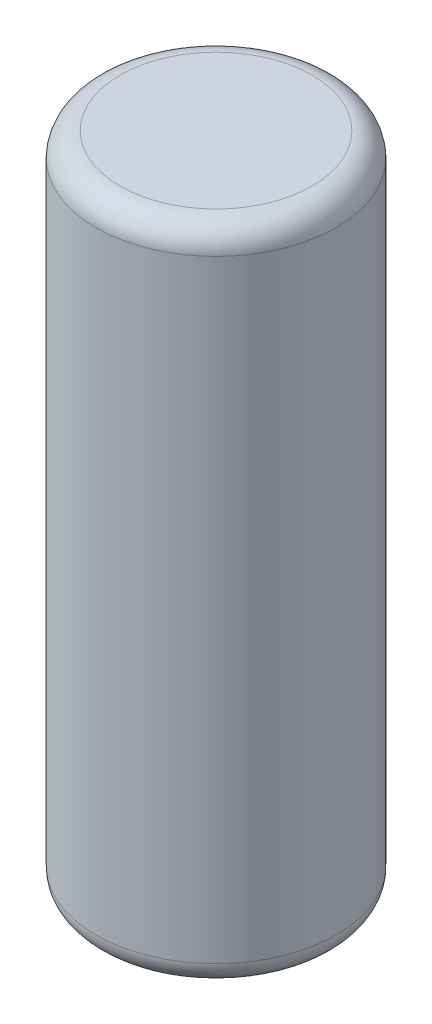
ISO-10303-21;
HEADER;
FILE_DESCRIPTION(('STEP AP214'),'2;1');
FILE_NAME('part.step','',(''),(''),'','','');
FILE_SCHEMA(('AUTOMOTIVE_DESIGN { 1 0 10303 214 1 1 1 1 }'));
ENDSEC;
DATA;
#1=APPLICATION_CONTEXT('core data for automotive mechanical design processes');
#2=APPLICATION_PROTOCOL_DEFINITION('international standard','automotive_design',2000,#1);
#3=PRODUCT_CONTEXT('',#1,'mechanical');
#4=PRODUCT('Part','Part','',(#3));
#5=PRODUCT_RELATED_PRODUCT_CATEGORY('part','',(#4));
#6=PRODUCT_DEFINITION_FORMATION('','',#4);
#7=PRODUCT_DEFINITION_CONTEXT('part definition',#1,'design');
#8=PRODUCT_DEFINITION('design','',#6,#7);
#9=PRODUCT_DEFINITION_SHAPE('','',#8);
#10=(LENGTH_UNIT() NAMED_UNIT(*) SI_UNIT(.MILLI.,.METRE.));
#11=(NAMED_UNIT(*) PLANE_ANGLE_UNIT() SI_UNIT($,.RADIAN.));
#12=(NAMED_UNIT(*) SI_UNIT($,.STERADIAN.) SOLID_ANGLE_UNIT());
#13=UNCERTAINTY_MEASURE_WITH_UNIT(LENGTH_MEASURE(1.E-05),#10,'distance_accuracy_value','');
#14=(GEOMETRIC_REPRESENTATION_CONTEXT(3) GLOBAL_UNCERTAINTY_ASSIGNED_CONTEXT((#13)) GLOBAL_UNIT_ASSIGNED_CONTEXT((#10,
#11,#12)) REPRESENTATION_CONTEXT('',''));
#15=CARTESIAN_POINT('',(0.,0.,0.));
#16=DIRECTION('',(0.,0.,1.));
#17=DIRECTION('',(1.,0.,0.));
#18=AXIS2_PLACEMENT_3D('',#15,#16,#17);
#19=CARTESIAN_POINT('',(0.,275.,0.));
#20=DIRECTION('',(0.,-1.,0.));
#21=DIRECTION('',(0.,0.,-1.));
#22=AXIS2_PLACEMENT_3D('',#19,#20,#21);
#23=CYLINDRICAL_SURFACE('',#22,50.);
#24=CARTESIAN_POINT('',(0.,265.,0.));
#25=DIRECTION('',(0.,1.,0.));
#26=DIRECTION('',(0.,0.,1.));
#27=AXIS2_PLACEMENT_3D('',#24,#25,#26);
#28=CIRCLE('',#27,50.);
#29=CARTESIAN_POINT('',(0.,265.,50.));
#30=VERTEX_POINT('',#29);
#31=EDGE_CURVE('E47',#30,#30,#28,.F.);
#32=ORIENTED_EDGE('',*,*,#31,.T.);
#33=EDGE_LOOP('',(#32));
#34=FACE_BOUND('',#33,.T.);
#35=CARTESIAN_POINT('',(0.,10.,0.));
#36=DIRECTION('',(0.,1.,0.));
#37=DIRECTION('',(0.,0.,1.));
#38=AXIS2_PLACEMENT_3D('',#35,#36,#37);
#39=CIRCLE('',#38,50.);
#40=CARTESIAN_POINT('',(0.,10.,50.));
#41=VERTEX_POINT('',#40);
#42=EDGE_CURVE('E52',#41,#41,#39,.T.);
#43=ORIENTED_EDGE('',*,*,#42,.T.);
#44=EDGE_LOOP('',(#43));
#45=FACE_BOUND('',#44,.T.);
#46=ADVANCED_FACE('F39',(#34,#45),#23,.T.);
#47=CARTESIAN_POINT('',(0.,275.,0.));
#48=DIRECTION('',(0.,1.,0.));
#49=DIRECTION('',(0.,0.,1.));
#50=AXIS2_PLACEMENT_3D('',#47,#48,#49);
#51=PLANE('',#50);
#52=CARTESIAN_POINT('',(0.,275.,0.));
#53=DIRECTION('',(0.,1.,0.));
#54=DIRECTION('',(0.,0.,1.));
#55=AXIS2_PLACEMENT_3D('',#52,#53,#54);
#56=CIRCLE('',#55,40.);
#57=CARTESIAN_POINT('',(0.,275.,40.));
#58=VERTEX_POINT('',#57);
#59=EDGE_CURVE('E57',#58,#58,#56,.T.);
#60=ORIENTED_EDGE('',*,*,#59,.T.);
#61=EDGE_LOOP('',(#60));
#62=FACE_BOUND('',#61,.T.);
#63=ADVANCED_FACE('F64',(#62),#51,.T.);
#64=CARTESIAN_POINT('',(0.,0.,0.));
#65=DIRECTION('',(0.,1.,0.));
#66=DIRECTION('',(0.,0.,1.));
#67=AXIS2_PLACEMENT_3D('',#64,#65,#66);
#68=PLANE('',#67);
#69=CARTESIAN_POINT('',(0.,0.,0.));
#70=DIRECTION('',(0.,1.,0.));
#71=DIRECTION('',(0.,0.,1.));
#72=AXIS2_PLACEMENT_3D('',#69,#70,#71);
#73=CIRCLE('',#72,40.);
#74=CARTESIAN_POINT('',(0.,0.,40.));
#75=VERTEX_POINT('',#74);
#76=EDGE_CURVE('E10',#75,#75,#73,.F.);
#77=ORIENTED_EDGE('',*,*,#76,.T.);
#78=EDGE_LOOP('',(#77));
#79=FACE_BOUND('',#78,.T.);
#80=ADVANCED_FACE('F68',(#79),#68,.F.);
#81=CARTESIAN_POINT('',(0.,265.,0.));
#82=DIRECTION('',(0.,1.,0.));
#83=DIRECTION('',(0.,0.,1.));
#84=AXIS2_PLACEMENT_3D('',#81,#82,#83);
#85=TOROIDAL_SURFACE('',#84,40.,10.);
#86=ORIENTED_EDGE('',*,*,#31,.F.);
#87=EDGE_LOOP('',(#86));
#88=FACE_BOUND('',#87,.T.);
#89=ORIENTED_EDGE('',*,*,#59,.F.);
#90=EDGE_LOOP('',(#89));
#91=FACE_BOUND('',#90,.T.);
#92=ADVANCED_FACE('F66',(#88,#91),#85,.T.);
#93=CARTESIAN_POINT('',(0.,10.,0.));
#94=DIRECTION('',(0.,1.,0.));
#95=DIRECTION('',(0.,0.,1.));
#96=AXIS2_PLACEMENT_3D('',#93,#94,#95);
#97=TOROIDAL_SURFACE('',#96,40.,10.);
#98=ORIENTED_EDGE('',*,*,#76,.F.);
#99=EDGE_LOOP('',(#98));
#100=FACE_BOUND('',#99,.T.);
#101=ORIENTED_EDGE('',*,*,#42,.F.);
#102=EDGE_LOOP('',(#101));
#103=FACE_BOUND('',#102,.T.);
#104=ADVANCED_FACE('F41',(#100,#103),#97,.T.);
#105=CLOSED_SHELL('',(#46,#63,#80,#92,#104));
#106=MANIFOLD_SOLID_BREP('B2',#105);
#107=ADVANCED_BREP_SHAPE_REPRESENTATION('',(#18,#106),#14);
#108=SHAPE_DEFINITION_REPRESENTATION(#9,#107);
ENDSEC;
END-ISO-10303-21;
